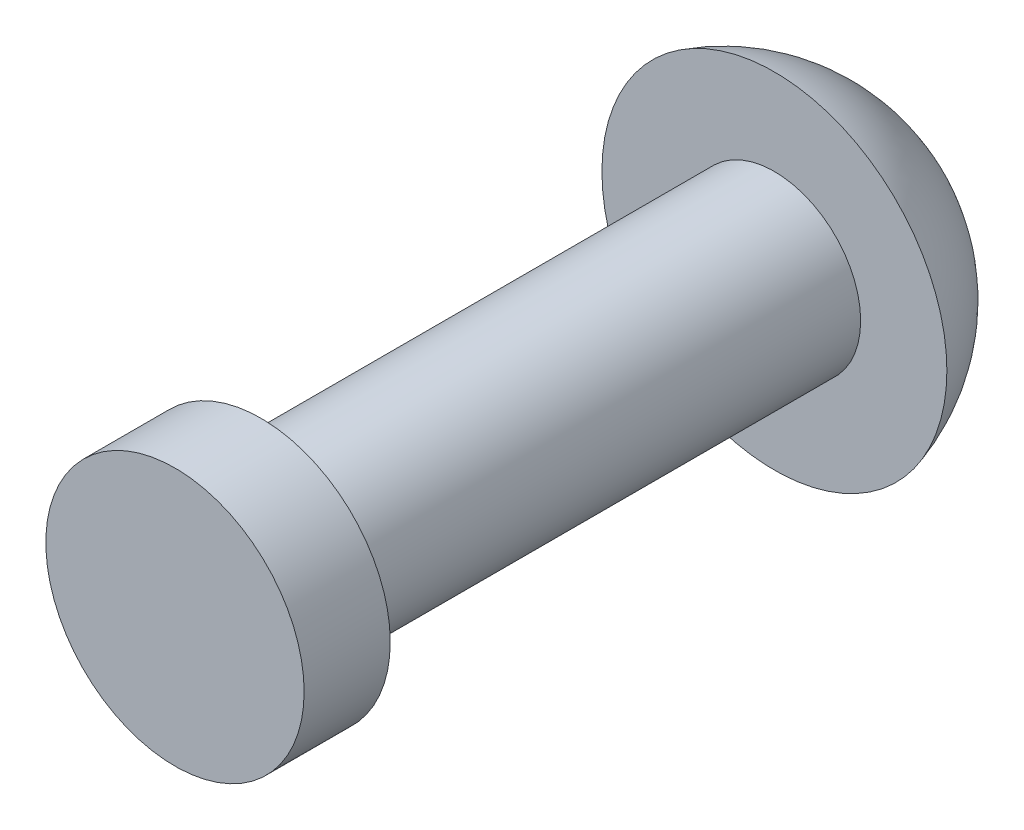
ISO-10303-21;
HEADER;
FILE_DESCRIPTION(('STEP AP214'),'2;1');
FILE_NAME('part.step','',(''),(''),'','','');
FILE_SCHEMA(('AUTOMOTIVE_DESIGN { 1 0 10303 214 1 1 1 1 }'));
ENDSEC;
DATA;
#1=APPLICATION_CONTEXT('core data for automotive mechanical design processes');
#2=APPLICATION_PROTOCOL_DEFINITION('international standard','automotive_design',2000,#1);
#3=PRODUCT_CONTEXT('',#1,'mechanical');
#4=PRODUCT('Part','Part','',(#3));
#5=PRODUCT_RELATED_PRODUCT_CATEGORY('part','',(#4));
#6=PRODUCT_DEFINITION_FORMATION('','',#4);
#7=PRODUCT_DEFINITION_CONTEXT('part definition',#1,'design');
#8=PRODUCT_DEFINITION('design','',#6,#7);
#9=PRODUCT_DEFINITION_SHAPE('','',#8);
#10=(LENGTH_UNIT() NAMED_UNIT(*) SI_UNIT(.MILLI.,.METRE.));
#11=(NAMED_UNIT(*) PLANE_ANGLE_UNIT() SI_UNIT($,.RADIAN.));
#12=(NAMED_UNIT(*) SI_UNIT($,.STERADIAN.) SOLID_ANGLE_UNIT());
#13=UNCERTAINTY_MEASURE_WITH_UNIT(LENGTH_MEASURE(1.E-05),#10,'distance_accuracy_value','');
#14=(GEOMETRIC_REPRESENTATION_CONTEXT(3) GLOBAL_UNCERTAINTY_ASSIGNED_CONTEXT((#13)) GLOBAL_UNIT_ASSIGNED_CONTEXT((#10,
#11,#12)) REPRESENTATION_CONTEXT('',''));
#15=CARTESIAN_POINT('',(0.,0.,0.));
#16=DIRECTION('',(0.,0.,1.));
#17=DIRECTION('',(1.,0.,0.));
#18=AXIS2_PLACEMENT_3D('',#15,#16,#17);
#19=CARTESIAN_POINT('',(0.,0.,13.7922));
#20=DIRECTION('',(0.,0.,-1.));
#21=DIRECTION('',(-1.,0.,0.));
#22=AXIS2_PLACEMENT_3D('',#19,#20,#21);
#23=CYLINDRICAL_SURFACE('',#22,1.984375);
#24=CARTESIAN_POINT('',(0.,0.,0.));
#25=DIRECTION('',(0.,0.,1.));
#26=DIRECTION('',(1.,0.,0.));
#27=AXIS2_PLACEMENT_3D('',#24,#25,#26);
#28=CIRCLE('',#27,1.984375);
#29=CARTESIAN_POINT('',(1.984375,0.,0.));
#30=VERTEX_POINT('',#29);
#31=EDGE_CURVE('E39',#30,#30,#28,.T.);
#32=ORIENTED_EDGE('',*,*,#31,.T.);
#33=EDGE_LOOP('',(#32));
#34=FACE_BOUND('',#33,.T.);
#35=CARTESIAN_POINT('',(0.,0.,11.811));
#36=DIRECTION('',(0.,0.,1.));
#37=DIRECTION('',(1.,0.,0.));
#38=AXIS2_PLACEMENT_3D('',#35,#36,#37);
#39=CIRCLE('',#38,1.984375);
#40=CARTESIAN_POINT('',(1.984375,0.,11.811));
#41=VERTEX_POINT('',#40);
#42=EDGE_CURVE('E12',#41,#41,#39,.T.);
#43=ORIENTED_EDGE('',*,*,#42,.F.);
#44=EDGE_LOOP('',(#43));
#45=FACE_BOUND('',#44,.T.);
#46=ADVANCED_FACE('F33',(#34,#45),#23,.T.);
#47=CARTESIAN_POINT('',(0.,0.,0.));
#48=DIRECTION('',(0.,0.,1.));
#49=DIRECTION('',(1.,0.,0.));
#50=AXIS2_PLACEMENT_3D('',#47,#48,#49);
#51=PLANE('',#50);
#52=CARTESIAN_POINT('',(0.,0.,0.));
#53=DIRECTION('',(0.,0.,1.));
#54=DIRECTION('',(1.,0.,0.));
#55=AXIS2_PLACEMENT_3D('',#52,#53,#54);
#56=CIRCLE('',#55,3.96875);
#57=CARTESIAN_POINT('',(3.96875,0.,0.));
#58=VERTEX_POINT('',#57);
#59=EDGE_CURVE('E43',#58,#58,#56,.T.);
#60=ORIENTED_EDGE('',*,*,#59,.T.);
#61=EDGE_LOOP('',(#60));
#62=FACE_BOUND('',#61,.T.);
#63=ORIENTED_EDGE('',*,*,#31,.F.);
#64=EDGE_LOOP('',(#63));
#65=FACE_BOUND('',#64,.T.);
#66=ADVANCED_FACE('F73',(#62,#65),#51,.T.);
#67=CARTESIAN_POINT('',(0.,0.,1.1641734508547));
#68=DIRECTION('',(0.,0.,1.));
#69=DIRECTION('',(1.,0.,0.));
#70=AXIS2_PLACEMENT_3D('',#67,#68,#69);
#71=SPHERICAL_SURFACE('',#70,4.1359734508547);
#72=ORIENTED_EDGE('',*,*,#59,.F.);
#73=EDGE_LOOP('',(#72));
#74=FACE_BOUND('',#73,.T.);
#75=ADVANCED_FACE('F67',(#74),#71,.T.);
#76=CARTESIAN_POINT('',(0.,0.,11.811));
#77=DIRECTION('',(0.,0.,1.));
#78=DIRECTION('',(1.,0.,0.));
#79=AXIS2_PLACEMENT_3D('',#76,#77,#78);
#80=PLANE('',#79);
#81=CARTESIAN_POINT('',(0.,0.,11.811));
#82=DIRECTION('',(0.,0.,1.));
#83=DIRECTION('',(1.,0.,0.));
#84=AXIS2_PLACEMENT_3D('',#81,#82,#83);
#85=CIRCLE('',#84,2.9718);
#86=CARTESIAN_POINT('',(2.9718,0.,11.811));
#87=VERTEX_POINT('',#86);
#88=EDGE_CURVE('E47',#87,#87,#85,.F.);
#89=ORIENTED_EDGE('',*,*,#88,.T.);
#90=EDGE_LOOP('',(#89));
#91=FACE_BOUND('',#90,.T.);
#92=ORIENTED_EDGE('',*,*,#42,.T.);
#93=EDGE_LOOP('',(#92));
#94=FACE_BOUND('',#93,.T.);
#95=ADVANCED_FACE('F60',(#91,#94),#80,.F.);
#96=CARTESIAN_POINT('',(0.,0.,-8.40551972932073));
#97=DIRECTION('',(0.,0.,1.));
#98=DIRECTION('',(1.,0.,0.));
#99=AXIS2_PLACEMENT_3D('',#96,#97,#98);
#100=CYLINDRICAL_SURFACE('',#99,2.9718);
#101=ORIENTED_EDGE('',*,*,#88,.F.);
#102=EDGE_LOOP('',(#101));
#103=FACE_BOUND('',#102,.T.);
#104=CARTESIAN_POINT('',(0.,0.,13.7922));
#105=DIRECTION('',(0.,0.,1.));
#106=DIRECTION('',(1.,0.,0.));
#107=AXIS2_PLACEMENT_3D('',#104,#105,#106);
#108=CIRCLE('',#107,2.9718);
#109=CARTESIAN_POINT('',(2.9718,0.,13.7922));
#110=VERTEX_POINT('',#109);
#111=EDGE_CURVE('E52',#110,#110,#108,.T.);
#112=ORIENTED_EDGE('',*,*,#111,.F.);
#113=EDGE_LOOP('',(#112));
#114=FACE_BOUND('',#113,.T.);
#115=ADVANCED_FACE('F58',(#103,#114),#100,.T.);
#116=CARTESIAN_POINT('',(0.,0.,13.7922));
#117=DIRECTION('',(0.,0.,1.));
#118=DIRECTION('',(1.,0.,0.));
#119=AXIS2_PLACEMENT_3D('',#116,#117,#118);
#120=PLANE('',#119);
#121=ORIENTED_EDGE('',*,*,#111,.T.);
#122=EDGE_LOOP('',(#121));
#123=FACE_BOUND('',#122,.T.);
#124=ADVANCED_FACE('F56',(#123),#120,.T.);
#125=CLOSED_SHELL('',(#46,#66,#75,#95,#115,#124));
#126=MANIFOLD_SOLID_BREP('B2',#125);
#127=ADVANCED_BREP_SHAPE_REPRESENTATION('',(#18,#126),#14);
#128=SHAPE_DEFINITION_REPRESENTATION(#9,#127);
ENDSEC;
END-ISO-10303-21;
